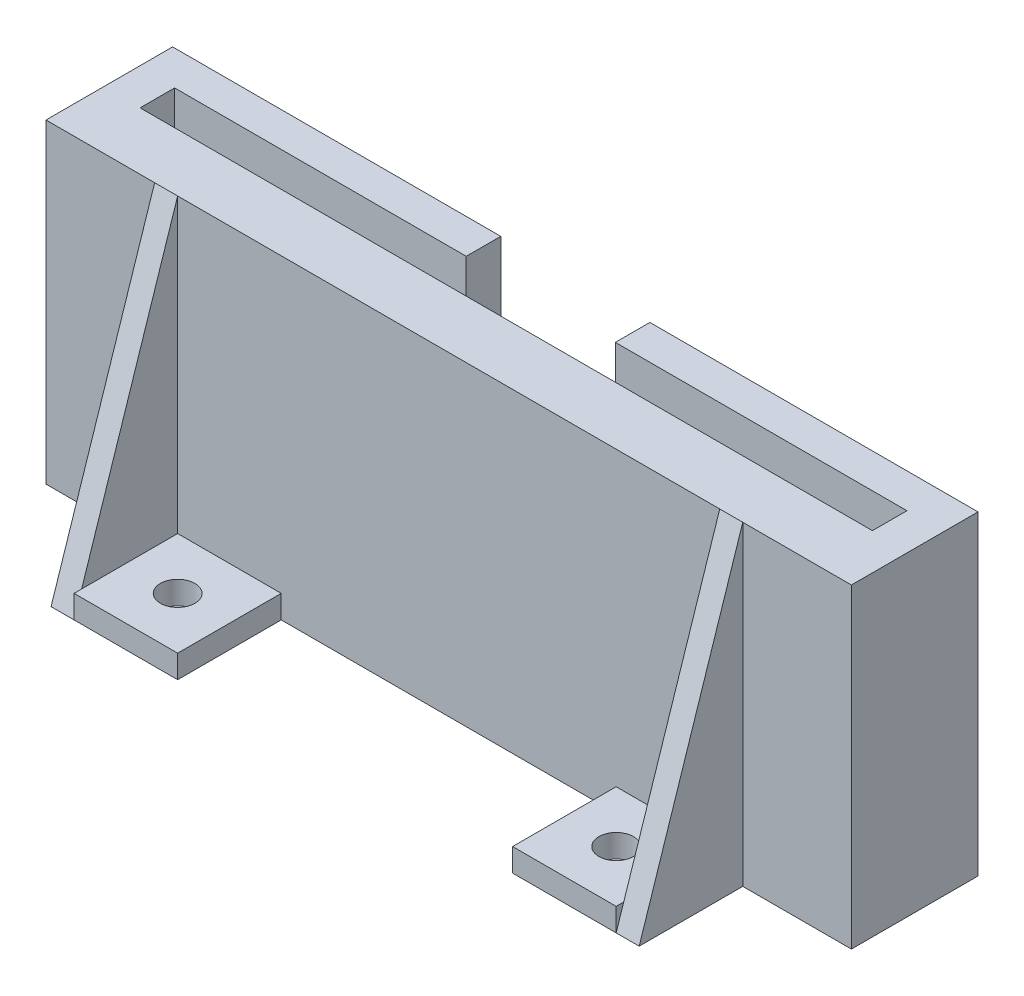
ISO-10303-21;
HEADER;
FILE_DESCRIPTION(('STEP AP214'),'2;1');
FILE_NAME('part.step','',(''),(''),'','','');
FILE_SCHEMA(('AUTOMOTIVE_DESIGN { 1 0 10303 214 1 1 1 1 }'));
ENDSEC;
DATA;
#1=APPLICATION_CONTEXT('core data for automotive mechanical design processes');
#2=APPLICATION_PROTOCOL_DEFINITION('international standard','automotive_design',2000,#1);
#3=PRODUCT_CONTEXT('',#1,'mechanical');
#4=PRODUCT('Part','Part','',(#3));
#5=PRODUCT_RELATED_PRODUCT_CATEGORY('part','',(#4));
#6=PRODUCT_DEFINITION_FORMATION('','',#4);
#7=PRODUCT_DEFINITION_CONTEXT('part definition',#1,'design');
#8=PRODUCT_DEFINITION('design','',#6,#7);
#9=PRODUCT_DEFINITION_SHAPE('','',#8);
#10=(LENGTH_UNIT() NAMED_UNIT(*) SI_UNIT(.MILLI.,.METRE.));
#11=(NAMED_UNIT(*) PLANE_ANGLE_UNIT() SI_UNIT($,.RADIAN.));
#12=(NAMED_UNIT(*) SI_UNIT($,.STERADIAN.) SOLID_ANGLE_UNIT());
#13=UNCERTAINTY_MEASURE_WITH_UNIT(LENGTH_MEASURE(1.E-05),#10,'distance_accuracy_value','');
#14=(GEOMETRIC_REPRESENTATION_CONTEXT(3) GLOBAL_UNCERTAINTY_ASSIGNED_CONTEXT((#13)) GLOBAL_UNIT_ASSIGNED_CONTEXT((#10,
#11,#12)) REPRESENTATION_CONTEXT('',''));
#15=CARTESIAN_POINT('',(0.,0.,0.));
#16=DIRECTION('',(0.,0.,1.));
#17=DIRECTION('',(1.,0.,0.));
#18=AXIS2_PLACEMENT_3D('',#15,#16,#17);
#19=CARTESIAN_POINT('',(0.,2.,5.50000000000001));
#20=DIRECTION('',(0.,0.,1.));
#21=DIRECTION('',(1.,0.,0.));
#22=AXIS2_PLACEMENT_3D('',#19,#20,#21);
#23=PLANE('',#22);
#24=DIRECTION('',(1.,0.,0.));
#25=VECTOR('',#24,1.);
#26=CARTESIAN_POINT('',(0.,27.4,5.50000000000001));
#27=LINE('',#26,#25);
#28=CARTESIAN_POINT('',(25.55,27.4,5.50000000000001));
#29=VERTEX_POINT('',#28);
#30=CARTESIAN_POINT('',(34.9885,27.4,5.50000000000001));
#31=VERTEX_POINT('',#30);
#32=EDGE_CURVE('E59',#29,#31,#27,.T.);
#33=ORIENTED_EDGE('',*,*,#32,.F.);
#34=DIRECTION('',(0.,1.,0.));
#35=VECTOR('',#34,1.);
#36=CARTESIAN_POINT('',(25.55,2.,5.50000000000001));
#37=LINE('',#36,#35);
#38=CARTESIAN_POINT('',(25.55,0.,5.50000000000001));
#39=VERTEX_POINT('',#38);
#40=EDGE_CURVE('E54',#39,#29,#37,.T.);
#41=ORIENTED_EDGE('',*,*,#40,.F.);
#42=DIRECTION('',(-1.,0.,0.));
#43=VECTOR('',#42,1.);
#44=CARTESIAN_POINT('',(0.,0.,5.50000000000001));
#45=LINE('',#44,#43);
#46=CARTESIAN_POINT('',(34.9885,0.,5.50000000000001));
#47=VERTEX_POINT('',#46);
#48=EDGE_CURVE('E223',#47,#39,#45,.T.);
#49=ORIENTED_EDGE('',*,*,#48,.F.);
#50=DIRECTION('',(0.,-1.,0.));
#51=VECTOR('',#50,1.);
#52=CARTESIAN_POINT('',(34.9885,2.,5.50000000000001));
#53=LINE('',#52,#51);
#54=EDGE_CURVE('E404',#31,#47,#53,.T.);
#55=ORIENTED_EDGE('',*,*,#54,.F.);
#56=EDGE_LOOP('',(#33,#41,#49,#55));
#57=FACE_BOUND('',#56,.T.);
#58=ADVANCED_FACE('F39',(#57),#23,.T.);
#59=CARTESIAN_POINT('',(23.55,2.,5.50000000000001));
#60=DIRECTION('',(1.,0.,0.));
#61=DIRECTION('',(0.,0.,-1.));
#62=AXIS2_PLACEMENT_3D('',#59,#60,#61);
#63=PLANE('',#62);
#64=DIRECTION('',(0.,-1.,0.));
#65=VECTOR('',#64,1.);
#66=CARTESIAN_POINT('',(23.55,2.,14.5));
#67=LINE('',#66,#65);
#68=CARTESIAN_POINT('',(23.55,2.,14.5));
#69=VERTEX_POINT('',#68);
#70=CARTESIAN_POINT('',(23.55,0.,14.5));
#71=VERTEX_POINT('',#70);
#72=EDGE_CURVE('E281',#69,#71,#67,.T.);
#73=ORIENTED_EDGE('',*,*,#72,.T.);
#74=DIRECTION('',(0.,-0.950061123965687,0.312063872835444));
#75=VECTOR('',#74,1.);
#76=CARTESIAN_POINT('',(23.55,4.47355006251806,13.0305857458883));
#77=LINE('',#76,#75);
#78=CARTESIAN_POINT('',(23.55,2.,13.8430656934308));
#79=VERTEX_POINT('',#78);
#80=EDGE_CURVE('E214',#79,#71,#77,.T.);
#81=ORIENTED_EDGE('',*,*,#80,.F.);
#82=DIRECTION('',(0.,0.,1.));
#83=VECTOR('',#82,1.);
#84=CARTESIAN_POINT('',(23.55,2.,5.50000000000001));
#85=LINE('',#84,#83);
#86=EDGE_CURVE('E268',#79,#69,#85,.T.);
#87=ORIENTED_EDGE('',*,*,#86,.T.);
#88=EDGE_LOOP('',(#73,#81,#87));
#89=FACE_BOUND('',#88,.T.);
#90=ADVANCED_FACE('F454',(#89),#63,.T.);
#91=CARTESIAN_POINT('',(-25.55,0.,5.50000000000001));
#92=VERTEX_POINT('',#91);
#93=CARTESIAN_POINT('',(-34.9885,0.,5.50000000000001));
#94=VERTEX_POINT('',#93);
#95=EDGE_CURVE('E399',#92,#94,#45,.T.);
#96=ORIENTED_EDGE('',*,*,#95,.F.);
#97=DIRECTION('',(0.,-1.,0.));
#98=VECTOR('',#97,1.);
#99=CARTESIAN_POINT('',(-25.55,27.4,5.50000000000007));
#100=LINE('',#99,#98);
#101=CARTESIAN_POINT('',(-25.55,27.4,5.50000000000001));
#102=VERTEX_POINT('',#101);
#103=EDGE_CURVE('E240',#102,#92,#100,.T.);
#104=ORIENTED_EDGE('',*,*,#103,.F.);
#105=CARTESIAN_POINT('',(-34.9885,27.4,5.50000000000001));
#106=VERTEX_POINT('',#105);
#107=EDGE_CURVE('E343',#106,#102,#27,.T.);
#108=ORIENTED_EDGE('',*,*,#107,.F.);
#109=DIRECTION('',(0.,-1.,0.));
#110=VECTOR('',#109,1.);
#111=CARTESIAN_POINT('',(-34.9885,2.,5.50000000000001));
#112=LINE('',#111,#110);
#113=EDGE_CURVE('E47',#106,#94,#112,.T.);
#114=ORIENTED_EDGE('',*,*,#113,.T.);
#115=EDGE_LOOP('',(#96,#104,#108,#114));
#116=FACE_BOUND('',#115,.T.);
#117=ADVANCED_FACE('F408',(#116),#23,.T.);
#118=CARTESIAN_POINT('',(-23.55,2.,5.50000000000001));
#119=DIRECTION('',(-1.,0.,0.));
#120=DIRECTION('',(0.,0.,1.));
#121=AXIS2_PLACEMENT_3D('',#118,#119,#120);
#122=PLANE('',#121);
#123=DIRECTION('',(0.,0.,-1.));
#124=VECTOR('',#123,1.);
#125=CARTESIAN_POINT('',(-23.55,2.,5.50000000000001));
#126=LINE('',#125,#124);
#127=CARTESIAN_POINT('',(-23.55,2.,14.5));
#128=VERTEX_POINT('',#127);
#129=CARTESIAN_POINT('',(-23.55,2.,13.8430656934307));
#130=VERTEX_POINT('',#129);
#131=EDGE_CURVE('E291',#128,#130,#126,.T.);
#132=ORIENTED_EDGE('',*,*,#131,.T.);
#133=DIRECTION('',(0.,0.950061123965687,-0.312063872835444));
#134=VECTOR('',#133,1.);
#135=CARTESIAN_POINT('',(-23.55,0.,14.5000000000001));
#136=LINE('',#135,#134);
#137=CARTESIAN_POINT('',(-23.55,0.,14.5));
#138=VERTEX_POINT('',#137);
#139=EDGE_CURVE('E244',#138,#130,#136,.T.);
#140=ORIENTED_EDGE('',*,*,#139,.F.);
#141=DIRECTION('',(0.,-1.,0.));
#142=VECTOR('',#141,1.);
#143=CARTESIAN_POINT('',(-23.55,2.,14.5));
#144=LINE('',#143,#142);
#145=EDGE_CURVE('E310',#128,#138,#144,.T.);
#146=ORIENTED_EDGE('',*,*,#145,.F.);
#147=EDGE_LOOP('',(#132,#140,#146));
#148=FACE_BOUND('',#147,.T.);
#149=ADVANCED_FACE('F463',(#148),#122,.T.);
#150=CARTESIAN_POINT('',(0.,2.,0.));
#151=DIRECTION('',(0.,1.,0.));
#152=DIRECTION('',(0.,0.,1.));
#153=AXIS2_PLACEMENT_3D('',#150,#151,#152);
#154=PLANE('',#153);
#155=DIRECTION('',(-1.,0.,0.));
#156=VECTOR('',#155,1.);
#157=CARTESIAN_POINT('',(0.,2.,-5.5));
#158=LINE('',#157,#156);
#159=CARTESIAN_POINT('',(6.477,2.,-5.5));
#160=VERTEX_POINT('',#159);
#161=CARTESIAN_POINT('',(-6.477,2.,-5.5));
#162=VERTEX_POINT('',#161);
#163=EDGE_CURVE('E389',#160,#162,#158,.T.);
#164=ORIENTED_EDGE('',*,*,#163,.T.);
#165=DIRECTION('',(0.,0.,1.));
#166=VECTOR('',#165,1.);
#167=CARTESIAN_POINT('',(-6.477,2.,0.));
#168=LINE('',#167,#166);
#169=CARTESIAN_POINT('',(-6.477,2.,-2.5));
#170=VERTEX_POINT('',#169);
#171=EDGE_CURVE('E313',#162,#170,#168,.T.);
#172=ORIENTED_EDGE('',*,*,#171,.T.);
#173=DIRECTION('',(-1.,0.,0.));
#174=VECTOR('',#173,1.);
#175=CARTESIAN_POINT('',(0.,2.,-2.5));
#176=LINE('',#175,#174);
#177=CARTESIAN_POINT('',(-31.8135,2.,-2.5));
#178=VERTEX_POINT('',#177);
#179=EDGE_CURVE('E356',#170,#178,#176,.T.);
#180=ORIENTED_EDGE('',*,*,#179,.T.);
#181=DIRECTION('',(0.,0.,-1.));
#182=VECTOR('',#181,1.);
#183=CARTESIAN_POINT('',(-31.8135,2.,0.));
#184=LINE('',#183,#182);
#185=CARTESIAN_POINT('',(-31.8135,2.,0.500000000000005));
#186=VERTEX_POINT('',#185);
#187=EDGE_CURVE('E359',#186,#178,#184,.T.);
#188=ORIENTED_EDGE('',*,*,#187,.F.);
#189=DIRECTION('',(-1.,0.,0.));
#190=VECTOR('',#189,1.);
#191=CARTESIAN_POINT('',(0.,2.,0.500000000000004));
#192=LINE('',#191,#190);
#193=CARTESIAN_POINT('',(31.8135,2.,0.500000000000004));
#194=VERTEX_POINT('',#193);
#195=EDGE_CURVE('E362',#194,#186,#192,.T.);
#196=ORIENTED_EDGE('',*,*,#195,.F.);
#197=DIRECTION('',(0.,0.,-1.));
#198=VECTOR('',#197,1.);
#199=CARTESIAN_POINT('',(31.8135,2.,0.));
#200=LINE('',#199,#198);
#201=CARTESIAN_POINT('',(31.8135,2.,-2.5));
#202=VERTEX_POINT('',#201);
#203=EDGE_CURVE('E364',#194,#202,#200,.T.);
#204=ORIENTED_EDGE('',*,*,#203,.T.);
#205=DIRECTION('',(1.,0.,0.));
#206=VECTOR('',#205,1.);
#207=CARTESIAN_POINT('',(0.,2.,-2.5));
#208=LINE('',#207,#206);
#209=CARTESIAN_POINT('',(6.477,2.,-2.5));
#210=VERTEX_POINT('',#209);
#211=EDGE_CURVE('E367',#210,#202,#208,.T.);
#212=ORIENTED_EDGE('',*,*,#211,.F.);
#213=DIRECTION('',(0.,0.,-1.));
#214=VECTOR('',#213,1.);
#215=CARTESIAN_POINT('',(6.477,2.,0.));
#216=LINE('',#215,#214);
#217=EDGE_CURVE('E322',#210,#160,#216,.T.);
#218=ORIENTED_EDGE('',*,*,#217,.T.);
#219=EDGE_LOOP('',(#164,#172,#180,#188,#196,#204,#212,#218));
#220=FACE_BOUND('',#219,.T.);
#221=ADVANCED_FACE('F472',(#220),#154,.T.);
#222=CARTESIAN_POINT('',(0.,2.,-5.5));
#223=DIRECTION('',(0.,0.,1.));
#224=DIRECTION('',(1.,0.,0.));
#225=AXIS2_PLACEMENT_3D('',#222,#223,#224);
#226=PLANE('',#225);
#227=DIRECTION('',(-1.,0.,0.));
#228=VECTOR('',#227,1.);
#229=CARTESIAN_POINT('',(0.,0.,-5.5));
#230=LINE('',#229,#228);
#231=CARTESIAN_POINT('',(34.9885,0.,-5.50000000000001));
#232=VERTEX_POINT('',#231);
#233=CARTESIAN_POINT('',(-34.9885,0.,-5.5));
#234=VERTEX_POINT('',#233);
#235=EDGE_CURVE('E374',#232,#234,#230,.T.);
#236=ORIENTED_EDGE('',*,*,#235,.T.);
#237=DIRECTION('',(0.,-1.,0.));
#238=VECTOR('',#237,1.);
#239=CARTESIAN_POINT('',(-34.9885,2.,-5.5));
#240=LINE('',#239,#238);
#241=CARTESIAN_POINT('',(-34.9885,27.4,-5.5));
#242=VERTEX_POINT('',#241);
#243=EDGE_CURVE('E11',#242,#234,#240,.T.);
#244=ORIENTED_EDGE('',*,*,#243,.F.);
#245=DIRECTION('',(1.,0.,0.));
#246=VECTOR('',#245,1.);
#247=CARTESIAN_POINT('',(0.,27.4,-5.5));
#248=LINE('',#247,#246);
#249=CARTESIAN_POINT('',(-6.477,27.4,-5.5));
#250=VERTEX_POINT('',#249);
#251=EDGE_CURVE('E350',#242,#250,#248,.T.);
#252=ORIENTED_EDGE('',*,*,#251,.T.);
#253=DIRECTION('',(0.,-1.,0.));
#254=VECTOR('',#253,1.);
#255=CARTESIAN_POINT('',(-6.477,27.4,-5.5));
#256=LINE('',#255,#254);
#257=EDGE_CURVE('E372',#250,#162,#256,.T.);
#258=ORIENTED_EDGE('',*,*,#257,.T.);
#259=ORIENTED_EDGE('',*,*,#163,.F.);
#260=DIRECTION('',(0.,-1.,0.));
#261=VECTOR('',#260,1.);
#262=CARTESIAN_POINT('',(6.477,27.4,-5.5));
#263=LINE('',#262,#261);
#264=CARTESIAN_POINT('',(6.477,27.4,-5.5));
#265=VERTEX_POINT('',#264);
#266=EDGE_CURVE('E375',#265,#160,#263,.T.);
#267=ORIENTED_EDGE('',*,*,#266,.F.);
#268=DIRECTION('',(1.,0.,0.));
#269=VECTOR('',#268,1.);
#270=CARTESIAN_POINT('',(0.,27.4,-5.5));
#271=LINE('',#270,#269);
#272=CARTESIAN_POINT('',(34.9885,27.4,-5.50000000000001));
#273=VERTEX_POINT('',#272);
#274=EDGE_CURVE('E337',#265,#273,#271,.T.);
#275=ORIENTED_EDGE('',*,*,#274,.T.);
#276=DIRECTION('',(0.,-1.,0.));
#277=VECTOR('',#276,1.);
#278=CARTESIAN_POINT('',(34.9885,2.,-5.50000000000001));
#279=LINE('',#278,#277);
#280=EDGE_CURVE('E392',#273,#232,#279,.T.);
#281=ORIENTED_EDGE('',*,*,#280,.T.);
#282=EDGE_LOOP('',(#236,#244,#252,#258,#259,#267,#275,#281));
#283=FACE_BOUND('',#282,.T.);
#284=ADVANCED_FACE('F41',(#283),#226,.F.);
#285=CARTESIAN_POINT('',(-34.9885,2.,0.));
#286=DIRECTION('',(1.,0.,0.));
#287=DIRECTION('',(0.,0.,-1.));
#288=AXIS2_PLACEMENT_3D('',#285,#286,#287);
#289=PLANE('',#288);
#290=DIRECTION('',(0.,0.,1.));
#291=VECTOR('',#290,1.);
#292=CARTESIAN_POINT('',(-34.9885,0.,0.));
#293=LINE('',#292,#291);
#294=EDGE_CURVE('E396',#234,#94,#293,.T.);
#295=ORIENTED_EDGE('',*,*,#294,.T.);
#296=ORIENTED_EDGE('',*,*,#113,.F.);
#297=DIRECTION('',(0.,0.,-1.));
#298=VECTOR('',#297,1.);
#299=CARTESIAN_POINT('',(-34.9885,27.4,0.));
#300=LINE('',#299,#298);
#301=EDGE_CURVE('E346',#106,#242,#300,.T.);
#302=ORIENTED_EDGE('',*,*,#301,.T.);
#303=ORIENTED_EDGE('',*,*,#243,.T.);
#304=EDGE_LOOP('',(#295,#296,#302,#303));
#305=FACE_BOUND('',#304,.T.);
#306=ADVANCED_FACE('F411',(#305),#289,.F.);
#307=DIRECTION('',(0.,1.,0.));
#308=VECTOR('',#307,1.);
#309=CARTESIAN_POINT('',(23.55,2.,5.50000000000001));
#310=LINE('',#309,#308);
#311=CARTESIAN_POINT('',(23.55,2.,5.50000000000001));
#312=VERTEX_POINT('',#311);
#313=CARTESIAN_POINT('',(23.55,27.4,5.50000000000001));
#314=VERTEX_POINT('',#313);
#315=EDGE_CURVE('E227',#312,#314,#310,.T.);
#316=ORIENTED_EDGE('',*,*,#315,.T.);
#317=CARTESIAN_POINT('',(-23.55,27.4,5.50000000000001));
#318=VERTEX_POINT('',#317);
#319=EDGE_CURVE('E347',#318,#314,#27,.T.);
#320=ORIENTED_EDGE('',*,*,#319,.F.);
#321=DIRECTION('',(0.,-1.,0.));
#322=VECTOR('',#321,1.);
#323=CARTESIAN_POINT('',(-23.55,27.4,5.50000000000007));
#324=LINE('',#323,#322);
#325=CARTESIAN_POINT('',(-23.55,2.,5.50000000000007));
#326=VERTEX_POINT('',#325);
#327=EDGE_CURVE('E237',#318,#326,#324,.T.);
#328=ORIENTED_EDGE('',*,*,#327,.T.);
#329=DIRECTION('',(1.,0.,0.));
#330=VECTOR('',#329,1.);
#331=CARTESIAN_POINT('',(-23.55,2.,5.50000000000001));
#332=LINE('',#331,#330);
#333=CARTESIAN_POINT('',(-14.55,2.,5.50000000000001));
#334=VERTEX_POINT('',#333);
#335=EDGE_CURVE('E294',#326,#334,#332,.T.);
#336=ORIENTED_EDGE('',*,*,#335,.T.);
#337=DIRECTION('',(0.,-1.,0.));
#338=VECTOR('',#337,1.);
#339=CARTESIAN_POINT('',(-14.55,2.,5.50000000000001));
#340=LINE('',#339,#338);
#341=CARTESIAN_POINT('',(-14.55,0.,5.50000000000001));
#342=VERTEX_POINT('',#341);
#343=EDGE_CURVE('E304',#334,#342,#340,.T.);
#344=ORIENTED_EDGE('',*,*,#343,.T.);
#345=CARTESIAN_POINT('',(14.55,0.,5.50000000000001));
#346=VERTEX_POINT('',#345);
#347=EDGE_CURVE('E401',#346,#342,#45,.T.);
#348=ORIENTED_EDGE('',*,*,#347,.F.);
#349=DIRECTION('',(0.,-1.,0.));
#350=VECTOR('',#349,1.);
#351=CARTESIAN_POINT('',(14.55,2.,5.50000000000001));
#352=LINE('',#351,#350);
#353=CARTESIAN_POINT('',(14.55,2.,5.50000000000001));
#354=VERTEX_POINT('',#353);
#355=EDGE_CURVE('E275',#354,#346,#352,.T.);
#356=ORIENTED_EDGE('',*,*,#355,.F.);
#357=DIRECTION('',(1.,0.,0.));
#358=VECTOR('',#357,1.);
#359=CARTESIAN_POINT('',(14.55,2.,5.50000000000001));
#360=LINE('',#359,#358);
#361=EDGE_CURVE('E264',#354,#312,#360,.T.);
#362=ORIENTED_EDGE('',*,*,#361,.T.);
#363=EDGE_LOOP('',(#316,#320,#328,#336,#344,#348,#356,#362));
#364=FACE_BOUND('',#363,.T.);
#365=ADVANCED_FACE('F424',(#364),#23,.T.);
#366=CARTESIAN_POINT('',(34.9885,2.,0.));
#367=DIRECTION('',(1.,0.,0.));
#368=DIRECTION('',(0.,0.,-1.));
#369=AXIS2_PLACEMENT_3D('',#366,#367,#368);
#370=PLANE('',#369);
#371=DIRECTION('',(0.,0.,1.));
#372=VECTOR('',#371,1.);
#373=CARTESIAN_POINT('',(34.9885,0.,0.));
#374=LINE('',#373,#372);
#375=EDGE_CURVE('E393',#232,#47,#374,.T.);
#376=ORIENTED_EDGE('',*,*,#375,.F.);
#377=ORIENTED_EDGE('',*,*,#280,.F.);
#378=DIRECTION('',(0.,0.,-1.));
#379=VECTOR('',#378,1.);
#380=CARTESIAN_POINT('',(34.9885,27.4,0.));
#381=LINE('',#380,#379);
#382=EDGE_CURVE('E340',#31,#273,#381,.T.);
#383=ORIENTED_EDGE('',*,*,#382,.F.);
#384=ORIENTED_EDGE('',*,*,#54,.T.);
#385=EDGE_LOOP('',(#376,#377,#383,#384));
#386=FACE_BOUND('',#385,.T.);
#387=ADVANCED_FACE('F451',(#386),#370,.T.);
#388=CARTESIAN_POINT('',(0.,0.,0.));
#389=DIRECTION('',(0.,1.,0.));
#390=DIRECTION('',(0.,0.,1.));
#391=AXIS2_PLACEMENT_3D('',#388,#389,#390);
#392=PLANE('',#391);
#393=DIRECTION('',(0.,0.,1.));
#394=VECTOR('',#393,1.);
#395=CARTESIAN_POINT('',(-25.55,0.,5.50000000000007));
#396=LINE('',#395,#394);
#397=CARTESIAN_POINT('',(-25.55,0.,14.5000000000001));
#398=VERTEX_POINT('',#397);
#399=EDGE_CURVE('E233',#92,#398,#396,.T.);
#400=ORIENTED_EDGE('',*,*,#399,.F.);
#401=ORIENTED_EDGE('',*,*,#95,.T.);
#402=ORIENTED_EDGE('',*,*,#294,.F.);
#403=ORIENTED_EDGE('',*,*,#235,.F.);
#404=ORIENTED_EDGE('',*,*,#375,.T.);
#405=ORIENTED_EDGE('',*,*,#48,.T.);
#406=DIRECTION('',(0.,0.,-1.));
#407=VECTOR('',#406,1.);
#408=CARTESIAN_POINT('',(25.55,0.,5.50000000000001));
#409=LINE('',#408,#407);
#410=CARTESIAN_POINT('',(25.55,0.,14.5000000000001));
#411=VERTEX_POINT('',#410);
#412=EDGE_CURVE('E204',#411,#39,#409,.T.);
#413=ORIENTED_EDGE('',*,*,#412,.F.);
#414=DIRECTION('',(-1.,0.,0.));
#415=VECTOR('',#414,1.);
#416=CARTESIAN_POINT('',(25.55,0.,14.5000000000001));
#417=LINE('',#416,#415);
#418=EDGE_CURVE('E210',#411,#71,#417,.T.);
#419=ORIENTED_EDGE('',*,*,#418,.T.);
#420=DIRECTION('',(-1.,0.,0.));
#421=VECTOR('',#420,1.);
#422=CARTESIAN_POINT('',(14.55,0.,14.5));
#423=LINE('',#422,#421);
#424=CARTESIAN_POINT('',(14.55,0.,14.5));
#425=VERTEX_POINT('',#424);
#426=EDGE_CURVE('E265',#71,#425,#423,.T.);
#427=ORIENTED_EDGE('',*,*,#426,.T.);
#428=DIRECTION('',(0.,0.,-1.));
#429=VECTOR('',#428,1.);
#430=CARTESIAN_POINT('',(14.55,0.,5.50000000000001));
#431=LINE('',#430,#429);
#432=EDGE_CURVE('E258',#425,#346,#431,.T.);
#433=ORIENTED_EDGE('',*,*,#432,.T.);
#434=ORIENTED_EDGE('',*,*,#347,.T.);
#435=DIRECTION('',(0.,0.,1.));
#436=VECTOR('',#435,1.);
#437=CARTESIAN_POINT('',(-14.55,0.,5.50000000000001));
#438=LINE('',#437,#436);
#439=CARTESIAN_POINT('',(-14.55,0.,14.5));
#440=VERTEX_POINT('',#439);
#441=EDGE_CURVE('E288',#342,#440,#438,.T.);
#442=ORIENTED_EDGE('',*,*,#441,.T.);
#443=DIRECTION('',(-1.,0.,0.));
#444=VECTOR('',#443,1.);
#445=CARTESIAN_POINT('',(-23.55,0.,14.5));
#446=LINE('',#445,#444);
#447=EDGE_CURVE('E307',#440,#138,#446,.T.);
#448=ORIENTED_EDGE('',*,*,#447,.T.);
#449=DIRECTION('',(1.,0.,0.));
#450=VECTOR('',#449,1.);
#451=CARTESIAN_POINT('',(-25.55,0.,14.5000000000001));
#452=LINE('',#451,#450);
#453=EDGE_CURVE('E251',#398,#138,#452,.T.);
#454=ORIENTED_EDGE('',*,*,#453,.F.);
#455=EDGE_LOOP('',(#400,#401,#402,#403,#404,#405,#413,#419,#427,#433,#434,#442,#448,#454));
#456=FACE_BOUND('',#455,.T.);
#457=CARTESIAN_POINT('',(-19.05,0.,10.));
#458=DIRECTION('',(0.,-1.,0.));
#459=DIRECTION('',(0.,0.,-1.));
#460=AXIS2_PLACEMENT_3D('',#457,#458,#459);
#461=CIRCLE('',#460,1.5);
#462=CARTESIAN_POINT('',(-19.05,0.,8.5));
#463=VERTEX_POINT('',#462);
#464=EDGE_CURVE('E280',#463,#463,#461,.T.);
#465=ORIENTED_EDGE('',*,*,#464,.F.);
#466=EDGE_LOOP('',(#465));
#467=FACE_BOUND('',#466,.T.);
#468=CARTESIAN_POINT('',(19.05,0.,10.));
#469=DIRECTION('',(0.,-1.,0.));
#470=DIRECTION('',(0.,0.,-1.));
#471=AXIS2_PLACEMENT_3D('',#468,#469,#470);
#472=CIRCLE('',#471,1.5);
#473=CARTESIAN_POINT('',(19.05,0.,8.50000000000001));
#474=VERTEX_POINT('',#473);
#475=EDGE_CURVE('E254',#474,#474,#472,.T.);
#476=ORIENTED_EDGE('',*,*,#475,.F.);
#477=EDGE_LOOP('',(#476));
#478=FACE_BOUND('',#477,.T.);
#479=ADVANCED_FACE('F220',(#456,#467,#478),#392,.F.);
#480=CARTESIAN_POINT('',(-6.477,27.4,0.));
#481=DIRECTION('',(1.,0.,0.));
#482=DIRECTION('',(0.,0.,-1.));
#483=AXIS2_PLACEMENT_3D('',#480,#481,#482);
#484=PLANE('',#483);
#485=ORIENTED_EDGE('',*,*,#171,.F.);
#486=ORIENTED_EDGE('',*,*,#257,.F.);
#487=DIRECTION('',(0.,0.,1.));
#488=VECTOR('',#487,1.);
#489=CARTESIAN_POINT('',(-6.477,27.4,0.));
#490=LINE('',#489,#488);
#491=CARTESIAN_POINT('',(-6.477,27.4,-2.5));
#492=VERTEX_POINT('',#491);
#493=EDGE_CURVE('E318',#250,#492,#490,.T.);
#494=ORIENTED_EDGE('',*,*,#493,.T.);
#495=DIRECTION('',(0.,-1.,0.));
#496=VECTOR('',#495,1.);
#497=CARTESIAN_POINT('',(-6.477,27.4,-2.5));
#498=LINE('',#497,#496);
#499=EDGE_CURVE('E353',#492,#170,#498,.T.);
#500=ORIENTED_EDGE('',*,*,#499,.T.);
#501=EDGE_LOOP('',(#485,#486,#494,#500));
#502=FACE_BOUND('',#501,.T.);
#503=ADVANCED_FACE('F485',(#502),#484,.T.);
#504=CARTESIAN_POINT('',(6.477,27.4,0.));
#505=DIRECTION('',(-1.,0.,0.));
#506=DIRECTION('',(0.,0.,1.));
#507=AXIS2_PLACEMENT_3D('',#504,#505,#506);
#508=PLANE('',#507);
#509=ORIENTED_EDGE('',*,*,#217,.F.);
#510=DIRECTION('',(0.,-1.,0.));
#511=VECTOR('',#510,1.);
#512=CARTESIAN_POINT('',(6.477,27.4,-2.5));
#513=LINE('',#512,#511);
#514=CARTESIAN_POINT('',(6.477,27.4,-2.5));
#515=VERTEX_POINT('',#514);
#516=EDGE_CURVE('E377',#515,#210,#513,.T.);
#517=ORIENTED_EDGE('',*,*,#516,.F.);
#518=DIRECTION('',(0.,0.,-1.));
#519=VECTOR('',#518,1.);
#520=CARTESIAN_POINT('',(6.477,27.4,0.));
#521=LINE('',#520,#519);
#522=EDGE_CURVE('E334',#515,#265,#521,.T.);
#523=ORIENTED_EDGE('',*,*,#522,.T.);
#524=ORIENTED_EDGE('',*,*,#266,.T.);
#525=EDGE_LOOP('',(#509,#517,#523,#524));
#526=FACE_BOUND('',#525,.T.);
#527=ADVANCED_FACE('F491',(#526),#508,.T.);
#528=CARTESIAN_POINT('',(0.,27.4,-2.5));
#529=DIRECTION('',(0.,0.,-1.));
#530=DIRECTION('',(-1.,0.,0.));
#531=AXIS2_PLACEMENT_3D('',#528,#529,#530);
#532=PLANE('',#531);
#533=ORIENTED_EDGE('',*,*,#211,.T.);
#534=DIRECTION('',(0.,-1.,0.));
#535=VECTOR('',#534,1.);
#536=CARTESIAN_POINT('',(31.8135,27.4,-2.5));
#537=LINE('',#536,#535);
#538=CARTESIAN_POINT('',(31.8135,27.4,-2.5));
#539=VERTEX_POINT('',#538);
#540=EDGE_CURVE('E379',#539,#202,#537,.T.);
#541=ORIENTED_EDGE('',*,*,#540,.F.);
#542=DIRECTION('',(1.,0.,0.));
#543=VECTOR('',#542,1.);
#544=CARTESIAN_POINT('',(0.,27.4,-2.5));
#545=LINE('',#544,#543);
#546=EDGE_CURVE('E332',#515,#539,#545,.T.);
#547=ORIENTED_EDGE('',*,*,#546,.F.);
#548=ORIENTED_EDGE('',*,*,#516,.T.);
#549=EDGE_LOOP('',(#533,#541,#547,#548));
#550=FACE_BOUND('',#549,.T.);
#551=ADVANCED_FACE('F496',(#550),#532,.F.);
#552=CARTESIAN_POINT('',(31.8135,27.4,0.));
#553=DIRECTION('',(-1.,0.,0.));
#554=DIRECTION('',(0.,0.,1.));
#555=AXIS2_PLACEMENT_3D('',#552,#553,#554);
#556=PLANE('',#555);
#557=ORIENTED_EDGE('',*,*,#203,.F.);
#558=DIRECTION('',(0.,-1.,0.));
#559=VECTOR('',#558,1.);
#560=CARTESIAN_POINT('',(31.8135,27.4,0.500000000000004));
#561=LINE('',#560,#559);
#562=CARTESIAN_POINT('',(31.8135,27.4,0.500000000000004));
#563=VERTEX_POINT('',#562);
#564=EDGE_CURVE('E381',#563,#194,#561,.T.);
#565=ORIENTED_EDGE('',*,*,#564,.F.);
#566=DIRECTION('',(0.,0.,-1.));
#567=VECTOR('',#566,1.);
#568=CARTESIAN_POINT('',(31.8135,27.4,0.));
#569=LINE('',#568,#567);
#570=EDGE_CURVE('E329',#563,#539,#569,.T.);
#571=ORIENTED_EDGE('',*,*,#570,.T.);
#572=ORIENTED_EDGE('',*,*,#540,.T.);
#573=EDGE_LOOP('',(#557,#565,#571,#572));
#574=FACE_BOUND('',#573,.T.);
#575=ADVANCED_FACE('F508',(#574),#556,.T.);
#576=CARTESIAN_POINT('',(0.,27.4,0.500000000000004));
#577=DIRECTION('',(0.,0.,1.));
#578=DIRECTION('',(1.,0.,0.));
#579=AXIS2_PLACEMENT_3D('',#576,#577,#578);
#580=PLANE('',#579);
#581=ORIENTED_EDGE('',*,*,#195,.T.);
#582=DIRECTION('',(0.,-1.,0.));
#583=VECTOR('',#582,1.);
#584=CARTESIAN_POINT('',(-31.8135,27.4,0.500000000000005));
#585=LINE('',#584,#583);
#586=CARTESIAN_POINT('',(-31.8135,27.4,0.500000000000005));
#587=VERTEX_POINT('',#586);
#588=EDGE_CURVE('E383',#587,#186,#585,.T.);
#589=ORIENTED_EDGE('',*,*,#588,.F.);
#590=DIRECTION('',(-1.,0.,0.));
#591=VECTOR('',#590,1.);
#592=CARTESIAN_POINT('',(0.,27.4,0.500000000000004));
#593=LINE('',#592,#591);
#594=EDGE_CURVE('E327',#563,#587,#593,.T.);
#595=ORIENTED_EDGE('',*,*,#594,.F.);
#596=ORIENTED_EDGE('',*,*,#564,.T.);
#597=EDGE_LOOP('',(#581,#589,#595,#596));
#598=FACE_BOUND('',#597,.T.);
#599=ADVANCED_FACE('F513',(#598),#580,.F.);
#600=CARTESIAN_POINT('',(-31.8135,27.4,0.));
#601=DIRECTION('',(-1.,0.,0.));
#602=DIRECTION('',(0.,0.,1.));
#603=AXIS2_PLACEMENT_3D('',#600,#601,#602);
#604=PLANE('',#603);
#605=ORIENTED_EDGE('',*,*,#187,.T.);
#606=DIRECTION('',(0.,-1.,0.));
#607=VECTOR('',#606,1.);
#608=CARTESIAN_POINT('',(-31.8135,27.4,-2.5));
#609=LINE('',#608,#607);
#610=CARTESIAN_POINT('',(-31.8135,27.4,-2.5));
#611=VERTEX_POINT('',#610);
#612=EDGE_CURVE('E386',#611,#178,#609,.T.);
#613=ORIENTED_EDGE('',*,*,#612,.F.);
#614=DIRECTION('',(0.,0.,-1.));
#615=VECTOR('',#614,1.);
#616=CARTESIAN_POINT('',(-31.8135,27.4,0.));
#617=LINE('',#616,#615);
#618=EDGE_CURVE('E325',#587,#611,#617,.T.);
#619=ORIENTED_EDGE('',*,*,#618,.F.);
#620=ORIENTED_EDGE('',*,*,#588,.T.);
#621=EDGE_LOOP('',(#605,#613,#619,#620));
#622=FACE_BOUND('',#621,.T.);
#623=ADVANCED_FACE('F517',(#622),#604,.F.);
#624=CARTESIAN_POINT('',(0.,27.4,-2.5));
#625=DIRECTION('',(0.,0.,1.));
#626=DIRECTION('',(1.,0.,0.));
#627=AXIS2_PLACEMENT_3D('',#624,#625,#626);
#628=PLANE('',#627);
#629=ORIENTED_EDGE('',*,*,#179,.F.);
#630=ORIENTED_EDGE('',*,*,#499,.F.);
#631=DIRECTION('',(-1.,0.,0.));
#632=VECTOR('',#631,1.);
#633=CARTESIAN_POINT('',(0.,27.4,-2.5));
#634=LINE('',#633,#632);
#635=EDGE_CURVE('E321',#492,#611,#634,.T.);
#636=ORIENTED_EDGE('',*,*,#635,.T.);
#637=ORIENTED_EDGE('',*,*,#612,.T.);
#638=EDGE_LOOP('',(#629,#630,#636,#637));
#639=FACE_BOUND('',#638,.T.);
#640=ADVANCED_FACE('F520',(#639),#628,.T.);
#641=CARTESIAN_POINT('',(0.,27.4,0.));
#642=DIRECTION('',(0.,-1.,0.));
#643=DIRECTION('',(0.,0.,-1.));
#644=AXIS2_PLACEMENT_3D('',#641,#642,#643);
#645=PLANE('',#644);
#646=ORIENTED_EDGE('',*,*,#493,.F.);
#647=ORIENTED_EDGE('',*,*,#251,.F.);
#648=ORIENTED_EDGE('',*,*,#301,.F.);
#649=ORIENTED_EDGE('',*,*,#107,.T.);
#650=DIRECTION('',(1.,0.,0.));
#651=VECTOR('',#650,1.);
#652=CARTESIAN_POINT('',(-25.55,27.4,5.50000000000007));
#653=LINE('',#652,#651);
#654=EDGE_CURVE('E243',#102,#318,#653,.T.);
#655=ORIENTED_EDGE('',*,*,#654,.T.);
#656=ORIENTED_EDGE('',*,*,#319,.T.);
#657=DIRECTION('',(-1.,0.,0.));
#658=VECTOR('',#657,1.);
#659=CARTESIAN_POINT('',(25.55,27.4,5.5000000000001));
#660=LINE('',#659,#658);
#661=EDGE_CURVE('E217',#29,#314,#660,.T.);
#662=ORIENTED_EDGE('',*,*,#661,.F.);
#663=ORIENTED_EDGE('',*,*,#32,.T.);
#664=ORIENTED_EDGE('',*,*,#382,.T.);
#665=ORIENTED_EDGE('',*,*,#274,.F.);
#666=ORIENTED_EDGE('',*,*,#522,.F.);
#667=ORIENTED_EDGE('',*,*,#546,.T.);
#668=ORIENTED_EDGE('',*,*,#570,.F.);
#669=ORIENTED_EDGE('',*,*,#594,.T.);
#670=ORIENTED_EDGE('',*,*,#618,.T.);
#671=ORIENTED_EDGE('',*,*,#635,.F.);
#672=EDGE_LOOP('',(#646,#647,#648,#649,#655,#656,#662,#663,#664,#665,#666,#667,#668,#669,#670,#671));
#673=FACE_BOUND('',#672,.T.);
#674=ADVANCED_FACE('F441',(#673),#645,.F.);
#675=CARTESIAN_POINT('',(-23.55,2.,14.5));
#676=DIRECTION('',(0.,0.,1.));
#677=DIRECTION('',(1.,0.,0.));
#678=AXIS2_PLACEMENT_3D('',#675,#676,#677);
#679=PLANE('',#678);
#680=ORIENTED_EDGE('',*,*,#447,.F.);
#681=DIRECTION('',(0.,-1.,0.));
#682=VECTOR('',#681,1.);
#683=CARTESIAN_POINT('',(-14.55,2.,14.5));
#684=LINE('',#683,#682);
#685=CARTESIAN_POINT('',(-14.55,2.,14.5));
#686=VERTEX_POINT('',#685);
#687=EDGE_CURVE('E314',#686,#440,#684,.T.);
#688=ORIENTED_EDGE('',*,*,#687,.F.);
#689=DIRECTION('',(-1.,0.,0.));
#690=VECTOR('',#689,1.);
#691=CARTESIAN_POINT('',(-23.55,2.,14.5));
#692=LINE('',#691,#690);
#693=EDGE_CURVE('E301',#686,#128,#692,.T.);
#694=ORIENTED_EDGE('',*,*,#693,.T.);
#695=ORIENTED_EDGE('',*,*,#145,.T.);
#696=EDGE_LOOP('',(#680,#688,#694,#695));
#697=FACE_BOUND('',#696,.T.);
#698=ADVANCED_FACE('F432',(#697),#679,.T.);
#699=CARTESIAN_POINT('',(-14.55,2.,5.50000000000001));
#700=DIRECTION('',(1.,0.,0.));
#701=DIRECTION('',(0.,0.,-1.));
#702=AXIS2_PLACEMENT_3D('',#699,#700,#701);
#703=PLANE('',#702);
#704=ORIENTED_EDGE('',*,*,#441,.F.);
#705=ORIENTED_EDGE('',*,*,#343,.F.);
#706=DIRECTION('',(0.,0.,1.));
#707=VECTOR('',#706,1.);
#708=CARTESIAN_POINT('',(-14.55,2.,5.50000000000001));
#709=LINE('',#708,#707);
#710=EDGE_CURVE('E298',#334,#686,#709,.T.);
#711=ORIENTED_EDGE('',*,*,#710,.T.);
#712=ORIENTED_EDGE('',*,*,#687,.T.);
#713=EDGE_LOOP('',(#704,#705,#711,#712));
#714=FACE_BOUND('',#713,.T.);
#715=ADVANCED_FACE('F422',(#714),#703,.T.);
#716=CARTESIAN_POINT('',(0.,2.,0.));
#717=DIRECTION('',(0.,1.,0.));
#718=DIRECTION('',(0.,0.,1.));
#719=AXIS2_PLACEMENT_3D('',#716,#717,#718);
#720=PLANE('',#719);
#721=CARTESIAN_POINT('',(-19.05,2.,10.));
#722=DIRECTION('',(0.,-1.,0.));
#723=DIRECTION('',(0.,0.,-1.));
#724=AXIS2_PLACEMENT_3D('',#721,#722,#723);
#725=CIRCLE('',#724,1.5);
#726=CARTESIAN_POINT('',(-19.05,2.,8.5));
#727=VERTEX_POINT('',#726);
#728=EDGE_CURVE('E285',#727,#727,#725,.T.);
#729=ORIENTED_EDGE('',*,*,#728,.T.);
#730=EDGE_LOOP('',(#729));
#731=FACE_BOUND('',#730,.T.);
#732=ORIENTED_EDGE('',*,*,#131,.F.);
#733=ORIENTED_EDGE('',*,*,#693,.F.);
#734=ORIENTED_EDGE('',*,*,#710,.F.);
#735=ORIENTED_EDGE('',*,*,#335,.F.);
#736=EDGE_CURVE('E295',#130,#326,#126,.T.);
#737=ORIENTED_EDGE('',*,*,#736,.F.);
#738=EDGE_LOOP('',(#732,#733,#734,#735,#737));
#739=FACE_BOUND('',#738,.T.);
#740=ADVANCED_FACE('F429',(#731,#739),#720,.T.);
#741=CARTESIAN_POINT('',(-19.05,2.,10.));
#742=DIRECTION('',(0.,-1.,0.));
#743=DIRECTION('',(0.,0.,-1.));
#744=AXIS2_PLACEMENT_3D('',#741,#742,#743);
#745=CYLINDRICAL_SURFACE('',#744,1.5);
#746=ORIENTED_EDGE('',*,*,#728,.F.);
#747=EDGE_LOOP('',(#746));
#748=FACE_BOUND('',#747,.T.);
#749=ORIENTED_EDGE('',*,*,#464,.T.);
#750=EDGE_LOOP('',(#749));
#751=FACE_BOUND('',#750,.T.);
#752=ADVANCED_FACE('F541',(#748,#751),#745,.F.);
#753=CARTESIAN_POINT('',(14.55,2.,5.50000000000001));
#754=DIRECTION('',(-1.,0.,0.));
#755=DIRECTION('',(0.,0.,1.));
#756=AXIS2_PLACEMENT_3D('',#753,#754,#755);
#757=PLANE('',#756);
#758=ORIENTED_EDGE('',*,*,#432,.F.);
#759=DIRECTION('',(0.,-1.,0.));
#760=VECTOR('',#759,1.);
#761=CARTESIAN_POINT('',(14.55,2.,14.5));
#762=LINE('',#761,#760);
#763=CARTESIAN_POINT('',(14.55,2.,14.5));
#764=VERTEX_POINT('',#763);
#765=EDGE_CURVE('E278',#764,#425,#762,.T.);
#766=ORIENTED_EDGE('',*,*,#765,.F.);
#767=DIRECTION('',(0.,0.,-1.));
#768=VECTOR('',#767,1.);
#769=CARTESIAN_POINT('',(14.55,2.,5.50000000000001));
#770=LINE('',#769,#768);
#771=EDGE_CURVE('E261',#764,#354,#770,.T.);
#772=ORIENTED_EDGE('',*,*,#771,.T.);
#773=ORIENTED_EDGE('',*,*,#355,.T.);
#774=EDGE_LOOP('',(#758,#766,#772,#773));
#775=FACE_BOUND('',#774,.T.);
#776=ADVANCED_FACE('F545',(#775),#757,.T.);
#777=CARTESIAN_POINT('',(14.55,2.,14.5));
#778=DIRECTION('',(0.,0.,1.));
#779=DIRECTION('',(1.,0.,0.));
#780=AXIS2_PLACEMENT_3D('',#777,#778,#779);
#781=PLANE('',#780);
#782=ORIENTED_EDGE('',*,*,#426,.F.);
#783=ORIENTED_EDGE('',*,*,#72,.F.);
#784=DIRECTION('',(-1.,0.,0.));
#785=VECTOR('',#784,1.);
#786=CARTESIAN_POINT('',(14.55,2.,14.5));
#787=LINE('',#786,#785);
#788=EDGE_CURVE('E272',#69,#764,#787,.T.);
#789=ORIENTED_EDGE('',*,*,#788,.T.);
#790=ORIENTED_EDGE('',*,*,#765,.T.);
#791=EDGE_LOOP('',(#782,#783,#789,#790));
#792=FACE_BOUND('',#791,.T.);
#793=ADVANCED_FACE('F548',(#792),#781,.T.);
#794=CARTESIAN_POINT('',(0.,2.,0.));
#795=DIRECTION('',(0.,1.,0.));
#796=DIRECTION('',(0.,0.,1.));
#797=AXIS2_PLACEMENT_3D('',#794,#795,#796);
#798=PLANE('',#797);
#799=CARTESIAN_POINT('',(19.05,2.,10.));
#800=DIRECTION('',(0.,-1.,0.));
#801=DIRECTION('',(0.,0.,-1.));
#802=AXIS2_PLACEMENT_3D('',#799,#800,#801);
#803=CIRCLE('',#802,1.5);
#804=CARTESIAN_POINT('',(19.05,2.,8.50000000000001));
#805=VERTEX_POINT('',#804);
#806=EDGE_CURVE('E255',#805,#805,#803,.T.);
#807=ORIENTED_EDGE('',*,*,#806,.T.);
#808=EDGE_LOOP('',(#807));
#809=FACE_BOUND('',#808,.T.);
#810=ORIENTED_EDGE('',*,*,#771,.F.);
#811=ORIENTED_EDGE('',*,*,#788,.F.);
#812=ORIENTED_EDGE('',*,*,#86,.F.);
#813=EDGE_CURVE('E269',#312,#79,#85,.T.);
#814=ORIENTED_EDGE('',*,*,#813,.F.);
#815=ORIENTED_EDGE('',*,*,#361,.F.);
#816=EDGE_LOOP('',(#810,#811,#812,#814,#815));
#817=FACE_BOUND('',#816,.T.);
#818=ADVANCED_FACE('F553',(#809,#817),#798,.T.);
#819=CARTESIAN_POINT('',(19.05,2.,10.));
#820=DIRECTION('',(0.,-1.,0.));
#821=DIRECTION('',(0.,0.,-1.));
#822=AXIS2_PLACEMENT_3D('',#819,#820,#821);
#823=CYLINDRICAL_SURFACE('',#822,1.5);
#824=ORIENTED_EDGE('',*,*,#806,.F.);
#825=EDGE_LOOP('',(#824));
#826=FACE_BOUND('',#825,.T.);
#827=ORIENTED_EDGE('',*,*,#475,.T.);
#828=EDGE_LOOP('',(#827));
#829=FACE_BOUND('',#828,.T.);
#830=ADVANCED_FACE('F557',(#826,#829),#823,.F.);
#831=CARTESIAN_POINT('',(-25.55,0.,14.5000000000001));
#832=DIRECTION('',(0.,-0.312063872835444,-0.950061123965687));
#833=DIRECTION('',(0.,0.950061123965687,-0.312063872835444));
#834=AXIS2_PLACEMENT_3D('',#831,#832,#833);
#835=PLANE('',#834);
#836=ORIENTED_EDGE('',*,*,#139,.T.);
#837=EDGE_CURVE('E232',#130,#318,#136,.T.);
#838=ORIENTED_EDGE('',*,*,#837,.T.);
#839=ORIENTED_EDGE('',*,*,#654,.F.);
#840=DIRECTION('',(0.,0.950061123965687,-0.312063872835444));
#841=VECTOR('',#840,1.);
#842=CARTESIAN_POINT('',(-25.55,0.,14.5000000000001));
#843=LINE('',#842,#841);
#844=EDGE_CURVE('E236',#398,#102,#843,.T.);
#845=ORIENTED_EDGE('',*,*,#844,.F.);
#846=ORIENTED_EDGE('',*,*,#453,.T.);
#847=EDGE_LOOP('',(#836,#838,#839,#845,#846));
#848=FACE_BOUND('',#847,.T.);
#849=ADVANCED_FACE('F434',(#848),#835,.F.);
#850=CARTESIAN_POINT('',(-25.55,0.,0.));
#851=DIRECTION('',(1.,0.,0.));
#852=DIRECTION('',(0.,0.,-1.));
#853=AXIS2_PLACEMENT_3D('',#850,#851,#852);
#854=PLANE('',#853);
#855=ORIENTED_EDGE('',*,*,#399,.T.);
#856=ORIENTED_EDGE('',*,*,#844,.T.);
#857=ORIENTED_EDGE('',*,*,#103,.T.);
#858=EDGE_LOOP('',(#855,#856,#857));
#859=FACE_BOUND('',#858,.T.);
#860=ADVANCED_FACE('F438',(#859),#854,.F.);
#861=CARTESIAN_POINT('',(-23.55,0.,0.));
#862=DIRECTION('',(1.,0.,0.));
#863=DIRECTION('',(0.,0.,-1.));
#864=AXIS2_PLACEMENT_3D('',#861,#862,#863);
#865=PLANE('',#864);
#866=ORIENTED_EDGE('',*,*,#837,.F.);
#867=ORIENTED_EDGE('',*,*,#736,.T.);
#868=ORIENTED_EDGE('',*,*,#327,.F.);
#869=EDGE_LOOP('',(#866,#867,#868));
#870=FACE_BOUND('',#869,.T.);
#871=ADVANCED_FACE('F564',(#870),#865,.T.);
#872=CARTESIAN_POINT('',(25.55,4.47355006251806,13.0305857458883));
#873=DIRECTION('',(0.,-0.312063872835444,-0.950061123965687));
#874=DIRECTION('',(0.,0.950061123965687,-0.312063872835444));
#875=AXIS2_PLACEMENT_3D('',#872,#873,#874);
#876=PLANE('',#875);
#877=EDGE_CURVE('E229',#314,#79,#77,.T.);
#878=ORIENTED_EDGE('',*,*,#877,.T.);
#879=ORIENTED_EDGE('',*,*,#80,.T.);
#880=ORIENTED_EDGE('',*,*,#418,.F.);
#881=DIRECTION('',(0.,-0.950061123965687,0.312063872835444));
#882=VECTOR('',#881,1.);
#883=CARTESIAN_POINT('',(25.55,4.47355006251806,13.0305857458883));
#884=LINE('',#883,#882);
#885=EDGE_CURVE('E200',#29,#411,#884,.T.);
#886=ORIENTED_EDGE('',*,*,#885,.F.);
#887=ORIENTED_EDGE('',*,*,#661,.T.);
#888=EDGE_LOOP('',(#878,#879,#880,#886,#887));
#889=FACE_BOUND('',#888,.T.);
#890=ADVANCED_FACE('F212',(#889),#876,.F.);
#891=CARTESIAN_POINT('',(25.55,0.,0.));
#892=DIRECTION('',(-1.,0.,0.));
#893=DIRECTION('',(0.,0.,1.));
#894=AXIS2_PLACEMENT_3D('',#891,#892,#893);
#895=PLANE('',#894);
#896=ORIENTED_EDGE('',*,*,#40,.T.);
#897=ORIENTED_EDGE('',*,*,#885,.T.);
#898=ORIENTED_EDGE('',*,*,#412,.T.);
#899=EDGE_LOOP('',(#896,#897,#898));
#900=FACE_BOUND('',#899,.T.);
#901=ADVANCED_FACE('F202',(#900),#895,.F.);
#902=CARTESIAN_POINT('',(23.55,0.,0.));
#903=DIRECTION('',(-1.,0.,0.));
#904=DIRECTION('',(0.,0.,1.));
#905=AXIS2_PLACEMENT_3D('',#902,#903,#904);
#906=PLANE('',#905);
#907=ORIENTED_EDGE('',*,*,#315,.F.);
#908=ORIENTED_EDGE('',*,*,#813,.T.);
#909=ORIENTED_EDGE('',*,*,#877,.F.);
#910=EDGE_LOOP('',(#907,#908,#909));
#911=FACE_BOUND('',#910,.T.);
#912=ADVANCED_FACE('F572',(#911),#906,.T.);
#913=CLOSED_SHELL('',(#58,#90,#117,#149,#221,#284,#306,#365,#387,#479,#503,#527,#551,#575,#599,
#623,#640,#674,#698,#715,#740,#752,#776,#793,#818,#830,#849,#860,#871,#890,#901,#912));
#914=MANIFOLD_SOLID_BREP('B2',#913);
#915=ADVANCED_BREP_SHAPE_REPRESENTATION('',(#18,#914),#14);
#916=SHAPE_DEFINITION_REPRESENTATION(#9,#915);
ENDSEC;
END-ISO-10303-21;
